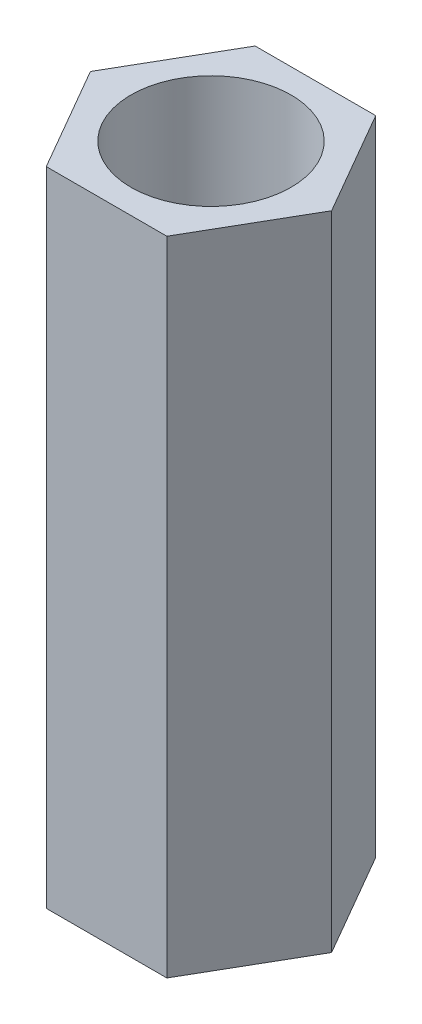
ISO-10303-21;
HEADER;
FILE_DESCRIPTION(('STEP AP214'),'2;1');
FILE_NAME('part.step','',(''),(''),'','','');
FILE_SCHEMA(('AUTOMOTIVE_DESIGN { 1 0 10303 214 1 1 1 1 }'));
ENDSEC;
DATA;
#1=APPLICATION_CONTEXT('core data for automotive mechanical design processes');
#2=APPLICATION_PROTOCOL_DEFINITION('international standard','automotive_design',2000,#1);
#3=PRODUCT_CONTEXT('',#1,'mechanical');
#4=PRODUCT('Part','Part','',(#3));
#5=PRODUCT_RELATED_PRODUCT_CATEGORY('part','',(#4));
#6=PRODUCT_DEFINITION_FORMATION('','',#4);
#7=PRODUCT_DEFINITION_CONTEXT('part definition',#1,'design');
#8=PRODUCT_DEFINITION('design','',#6,#7);
#9=PRODUCT_DEFINITION_SHAPE('','',#8);
#10=(LENGTH_UNIT() NAMED_UNIT(*) SI_UNIT(.MILLI.,.METRE.));
#11=(NAMED_UNIT(*) PLANE_ANGLE_UNIT() SI_UNIT($,.RADIAN.));
#12=(NAMED_UNIT(*) SI_UNIT($,.STERADIAN.) SOLID_ANGLE_UNIT());
#13=UNCERTAINTY_MEASURE_WITH_UNIT(LENGTH_MEASURE(1.E-05),#10,'distance_accuracy_value','');
#14=(GEOMETRIC_REPRESENTATION_CONTEXT(3) GLOBAL_UNCERTAINTY_ASSIGNED_CONTEXT((#13)) GLOBAL_UNIT_ASSIGNED_CONTEXT((#10,
#11,#12)) REPRESENTATION_CONTEXT('',''));
#15=CARTESIAN_POINT('',(0.,0.,0.));
#16=DIRECTION('',(0.,0.,1.));
#17=DIRECTION('',(1.,0.,0.));
#18=AXIS2_PLACEMENT_3D('',#15,#16,#17);
#19=CARTESIAN_POINT('',(0.,10.43,0.));
#20=DIRECTION('',(0.,1.,0.));
#21=DIRECTION('',(0.,0.,1.));
#22=AXIS2_PLACEMENT_3D('',#19,#20,#21);
#23=PLANE('',#22);
#24=DIRECTION('',(1.,0.,0.));
#25=VECTOR('',#24,1.);
#26=CARTESIAN_POINT('',(-0.979018569486717,10.43,1.6957099039044));
#27=LINE('',#26,#25);
#28=CARTESIAN_POINT('',(-0.979018569486717,10.43,1.6957099039044));
#29=VERTEX_POINT('',#28);
#30=CARTESIAN_POINT('',(0.979018569486719,10.43,1.6957099039044));
#31=VERTEX_POINT('',#30);
#32=EDGE_CURVE('E129',#29,#31,#27,.T.);
#33=ORIENTED_EDGE('',*,*,#32,.T.);
#34=DIRECTION('',(0.5,0.,-0.866025403784439));
#35=VECTOR('',#34,1.);
#36=CARTESIAN_POINT('',(0.979018569486719,10.43,1.6957099039044));
#37=LINE('',#36,#35);
#38=CARTESIAN_POINT('',(1.95803713897344,10.43,0.));
#39=VERTEX_POINT('',#38);
#40=EDGE_CURVE('E87',#31,#39,#37,.T.);
#41=ORIENTED_EDGE('',*,*,#40,.T.);
#42=DIRECTION('',(-0.5,0.,-0.866025403784438));
#43=VECTOR('',#42,1.);
#44=CARTESIAN_POINT('',(1.95803713897344,10.43,0.));
#45=LINE('',#44,#43);
#46=CARTESIAN_POINT('',(0.979018569486718,10.43,-1.6957099039044));
#47=VERTEX_POINT('',#46);
#48=EDGE_CURVE('E100',#39,#47,#45,.T.);
#49=ORIENTED_EDGE('',*,*,#48,.T.);
#50=DIRECTION('',(-1.,0.,0.));
#51=VECTOR('',#50,1.);
#52=CARTESIAN_POINT('',(0.979018569486718,10.43,-1.6957099039044));
#53=LINE('',#52,#51);
#54=CARTESIAN_POINT('',(-0.979018569486718,10.43,-1.6957099039044));
#55=VERTEX_POINT('',#54);
#56=EDGE_CURVE('E94',#47,#55,#53,.T.);
#57=ORIENTED_EDGE('',*,*,#56,.T.);
#58=DIRECTION('',(-0.5,0.,0.866025403784439));
#59=VECTOR('',#58,1.);
#60=CARTESIAN_POINT('',(-0.979018569486718,10.43,-1.6957099039044));
#61=LINE('',#60,#59);
#62=CARTESIAN_POINT('',(-1.95803713897344,10.43,0.));
#63=VERTEX_POINT('',#62);
#64=EDGE_CURVE('E98',#55,#63,#61,.T.);
#65=ORIENTED_EDGE('',*,*,#64,.T.);
#66=DIRECTION('',(0.5,0.,0.866025403784438));
#67=VECTOR('',#66,1.);
#68=CARTESIAN_POINT('',(-1.95803713897344,10.43,0.));
#69=LINE('',#68,#67);
#70=EDGE_CURVE('E50',#63,#29,#69,.T.);
#71=ORIENTED_EDGE('',*,*,#70,.T.);
#72=EDGE_LOOP('',(#33,#41,#49,#57,#65,#71));
#73=FACE_BOUND('',#72,.T.);
#74=CARTESIAN_POINT('',(0.,10.43,0.));
#75=DIRECTION('',(0.,1.,0.));
#76=DIRECTION('',(0.,0.,1.));
#77=AXIS2_PLACEMENT_3D('',#74,#75,#76);
#78=CIRCLE('',#77,1.3);
#79=CARTESIAN_POINT('',(0.,10.43,1.3));
#80=VERTEX_POINT('',#79);
#81=EDGE_CURVE('E122',#80,#80,#78,.T.);
#82=ORIENTED_EDGE('',*,*,#81,.F.);
#83=EDGE_LOOP('',(#82));
#84=FACE_BOUND('',#83,.T.);
#85=ADVANCED_FACE('F33',(#73,#84),#23,.T.);
#86=CARTESIAN_POINT('',(0.,0.,0.));
#87=DIRECTION('',(0.,1.,0.));
#88=DIRECTION('',(0.,0.,1.));
#89=AXIS2_PLACEMENT_3D('',#86,#87,#88);
#90=PLANE('',#89);
#91=DIRECTION('',(1.,0.,0.));
#92=VECTOR('',#91,1.);
#93=CARTESIAN_POINT('',(-0.979018569486717,0.,1.6957099039044));
#94=LINE('',#93,#92);
#95=CARTESIAN_POINT('',(-0.979018569486717,0.,1.6957099039044));
#96=VERTEX_POINT('',#95);
#97=CARTESIAN_POINT('',(0.979018569486719,0.,1.6957099039044));
#98=VERTEX_POINT('',#97);
#99=EDGE_CURVE('E118',#96,#98,#94,.T.);
#100=ORIENTED_EDGE('',*,*,#99,.F.);
#101=DIRECTION('',(0.5,0.,0.866025403784438));
#102=VECTOR('',#101,1.);
#103=CARTESIAN_POINT('',(-1.95803713897344,0.,0.));
#104=LINE('',#103,#102);
#105=CARTESIAN_POINT('',(-1.95803713897344,0.,0.));
#106=VERTEX_POINT('',#105);
#107=EDGE_CURVE('E79',#106,#96,#104,.T.);
#108=ORIENTED_EDGE('',*,*,#107,.F.);
#109=DIRECTION('',(-0.5,0.,0.866025403784439));
#110=VECTOR('',#109,1.);
#111=CARTESIAN_POINT('',(-0.979018569486718,0.,-1.6957099039044));
#112=LINE('',#111,#110);
#113=CARTESIAN_POINT('',(-0.979018569486718,0.,-1.6957099039044));
#114=VERTEX_POINT('',#113);
#115=EDGE_CURVE('E73',#114,#106,#112,.T.);
#116=ORIENTED_EDGE('',*,*,#115,.F.);
#117=DIRECTION('',(-1.,0.,0.));
#118=VECTOR('',#117,1.);
#119=CARTESIAN_POINT('',(0.979018569486718,0.,-1.6957099039044));
#120=LINE('',#119,#118);
#121=CARTESIAN_POINT('',(0.979018569486718,0.,-1.6957099039044));
#122=VERTEX_POINT('',#121);
#123=EDGE_CURVE('E108',#122,#114,#120,.T.);
#124=ORIENTED_EDGE('',*,*,#123,.F.);
#125=DIRECTION('',(-0.5,0.,-0.866025403784438));
#126=VECTOR('',#125,1.);
#127=CARTESIAN_POINT('',(1.95803713897344,0.,0.));
#128=LINE('',#127,#126);
#129=CARTESIAN_POINT('',(1.95803713897344,0.,0.));
#130=VERTEX_POINT('',#129);
#131=EDGE_CURVE('E124',#130,#122,#128,.T.);
#132=ORIENTED_EDGE('',*,*,#131,.F.);
#133=DIRECTION('',(0.5,0.,-0.866025403784439));
#134=VECTOR('',#133,1.);
#135=CARTESIAN_POINT('',(0.979018569486719,0.,1.6957099039044));
#136=LINE('',#135,#134);
#137=EDGE_CURVE('E121',#98,#130,#136,.T.);
#138=ORIENTED_EDGE('',*,*,#137,.F.);
#139=EDGE_LOOP('',(#100,#108,#116,#124,#132,#138));
#140=FACE_BOUND('',#139,.T.);
#141=CARTESIAN_POINT('',(0.,0.,0.));
#142=DIRECTION('',(0.,1.,0.));
#143=DIRECTION('',(0.,0.,1.));
#144=AXIS2_PLACEMENT_3D('',#141,#142,#143);
#145=CIRCLE('',#144,1.3);
#146=CARTESIAN_POINT('',(0.,0.,1.3));
#147=VERTEX_POINT('',#146);
#148=EDGE_CURVE('E222',#147,#147,#145,.T.);
#149=ORIENTED_EDGE('',*,*,#148,.T.);
#150=EDGE_LOOP('',(#149));
#151=FACE_BOUND('',#150,.T.);
#152=ADVANCED_FACE('F138',(#140,#151),#90,.F.);
#153=CARTESIAN_POINT('',(-0.979018569486717,10.43,1.6957099039044));
#154=DIRECTION('',(0.,0.,-1.));
#155=DIRECTION('',(-1.,0.,0.));
#156=AXIS2_PLACEMENT_3D('',#153,#154,#155);
#157=PLANE('',#156);
#158=ORIENTED_EDGE('',*,*,#99,.T.);
#159=DIRECTION('',(0.,-1.,0.));
#160=VECTOR('',#159,1.);
#161=CARTESIAN_POINT('',(0.979018569486719,10.43,1.6957099039044));
#162=LINE('',#161,#160);
#163=EDGE_CURVE('E11',#31,#98,#162,.T.);
#164=ORIENTED_EDGE('',*,*,#163,.F.);
#165=ORIENTED_EDGE('',*,*,#32,.F.);
#166=DIRECTION('',(0.,-1.,0.));
#167=VECTOR('',#166,1.);
#168=CARTESIAN_POINT('',(-0.979018569486717,10.43,1.6957099039044));
#169=LINE('',#168,#167);
#170=EDGE_CURVE('E114',#29,#96,#169,.T.);
#171=ORIENTED_EDGE('',*,*,#170,.T.);
#172=EDGE_LOOP('',(#158,#164,#165,#171));
#173=FACE_BOUND('',#172,.T.);
#174=ADVANCED_FACE('F35',(#173),#157,.F.);
#175=CARTESIAN_POINT('',(0.979018569486719,10.43,1.6957099039044));
#176=DIRECTION('',(-0.866025403784439,0.,-0.5));
#177=DIRECTION('',(-0.5,0.,0.866025403784439));
#178=AXIS2_PLACEMENT_3D('',#175,#176,#177);
#179=PLANE('',#178);
#180=ORIENTED_EDGE('',*,*,#137,.T.);
#181=DIRECTION('',(0.,-1.,0.));
#182=VECTOR('',#181,1.);
#183=CARTESIAN_POINT('',(1.95803713897344,10.43,0.));
#184=LINE('',#183,#182);
#185=EDGE_CURVE('E42',#39,#130,#184,.T.);
#186=ORIENTED_EDGE('',*,*,#185,.F.);
#187=ORIENTED_EDGE('',*,*,#40,.F.);
#188=ORIENTED_EDGE('',*,*,#163,.T.);
#189=EDGE_LOOP('',(#180,#186,#187,#188));
#190=FACE_BOUND('',#189,.T.);
#191=ADVANCED_FACE('F163',(#190),#179,.F.);
#192=CARTESIAN_POINT('',(1.95803713897344,10.43,0.));
#193=DIRECTION('',(-0.866025403784438,0.,0.5));
#194=DIRECTION('',(0.5,0.,0.866025403784439));
#195=AXIS2_PLACEMENT_3D('',#192,#193,#194);
#196=PLANE('',#195);
#197=ORIENTED_EDGE('',*,*,#131,.T.);
#198=DIRECTION('',(0.,-1.,0.));
#199=VECTOR('',#198,1.);
#200=CARTESIAN_POINT('',(0.979018569486718,10.43,-1.6957099039044));
#201=LINE('',#200,#199);
#202=EDGE_CURVE('E109',#47,#122,#201,.T.);
#203=ORIENTED_EDGE('',*,*,#202,.F.);
#204=ORIENTED_EDGE('',*,*,#48,.F.);
#205=ORIENTED_EDGE('',*,*,#185,.T.);
#206=EDGE_LOOP('',(#197,#203,#204,#205));
#207=FACE_BOUND('',#206,.T.);
#208=ADVANCED_FACE('F135',(#207),#196,.F.);
#209=CARTESIAN_POINT('',(0.979018569486718,10.43,-1.6957099039044));
#210=DIRECTION('',(0.,0.,1.));
#211=DIRECTION('',(1.,0.,0.));
#212=AXIS2_PLACEMENT_3D('',#209,#210,#211);
#213=PLANE('',#212);
#214=ORIENTED_EDGE('',*,*,#123,.T.);
#215=DIRECTION('',(0.,-1.,0.));
#216=VECTOR('',#215,1.);
#217=CARTESIAN_POINT('',(-0.979018569486718,10.43,-1.6957099039044));
#218=LINE('',#217,#216);
#219=EDGE_CURVE('E105',#55,#114,#218,.T.);
#220=ORIENTED_EDGE('',*,*,#219,.F.);
#221=ORIENTED_EDGE('',*,*,#56,.F.);
#222=ORIENTED_EDGE('',*,*,#202,.T.);
#223=EDGE_LOOP('',(#214,#220,#221,#222));
#224=FACE_BOUND('',#223,.T.);
#225=ADVANCED_FACE('F106',(#224),#213,.F.);
#226=CARTESIAN_POINT('',(-0.979018569486718,10.43,-1.6957099039044));
#227=DIRECTION('',(0.866025403784439,0.,0.5));
#228=DIRECTION('',(0.5,0.,-0.866025403784439));
#229=AXIS2_PLACEMENT_3D('',#226,#227,#228);
#230=PLANE('',#229);
#231=ORIENTED_EDGE('',*,*,#115,.T.);
#232=DIRECTION('',(0.,-1.,0.));
#233=VECTOR('',#232,1.);
#234=CARTESIAN_POINT('',(-1.95803713897344,10.43,0.));
#235=LINE('',#234,#233);
#236=EDGE_CURVE('E110',#63,#106,#235,.T.);
#237=ORIENTED_EDGE('',*,*,#236,.F.);
#238=ORIENTED_EDGE('',*,*,#64,.F.);
#239=ORIENTED_EDGE('',*,*,#219,.T.);
#240=EDGE_LOOP('',(#231,#237,#238,#239));
#241=FACE_BOUND('',#240,.T.);
#242=ADVANCED_FACE('F112',(#241),#230,.F.);
#243=CARTESIAN_POINT('',(-1.95803713897344,10.43,0.));
#244=DIRECTION('',(0.866025403784438,0.,-0.5));
#245=DIRECTION('',(-0.5,0.,-0.866025403784438));
#246=AXIS2_PLACEMENT_3D('',#243,#244,#245);
#247=PLANE('',#246);
#248=ORIENTED_EDGE('',*,*,#107,.T.);
#249=ORIENTED_EDGE('',*,*,#170,.F.);
#250=ORIENTED_EDGE('',*,*,#70,.F.);
#251=ORIENTED_EDGE('',*,*,#236,.T.);
#252=EDGE_LOOP('',(#248,#249,#250,#251));
#253=FACE_BOUND('',#252,.T.);
#254=ADVANCED_FACE('F143',(#253),#247,.F.);
#255=CARTESIAN_POINT('',(0.,10.43,0.));
#256=DIRECTION('',(0.,-1.,0.));
#257=DIRECTION('',(0.,0.,-1.));
#258=AXIS2_PLACEMENT_3D('',#255,#256,#257);
#259=CYLINDRICAL_SURFACE('',#258,1.3);
#260=ORIENTED_EDGE('',*,*,#81,.T.);
#261=EDGE_LOOP('',(#260));
#262=FACE_BOUND('',#261,.T.);
#263=ORIENTED_EDGE('',*,*,#148,.F.);
#264=EDGE_LOOP('',(#263));
#265=FACE_BOUND('',#264,.T.);
#266=ADVANCED_FACE('F145',(#262,#265),#259,.F.);
#267=CLOSED_SHELL('',(#85,#152,#174,#191,#208,#225,#242,#254,#266));
#268=MANIFOLD_SOLID_BREP('B2',#267);
#269=ADVANCED_BREP_SHAPE_REPRESENTATION('',(#18,#268),#14);
#270=SHAPE_DEFINITION_REPRESENTATION(#9,#269);
ENDSEC;
END-ISO-10303-21;
